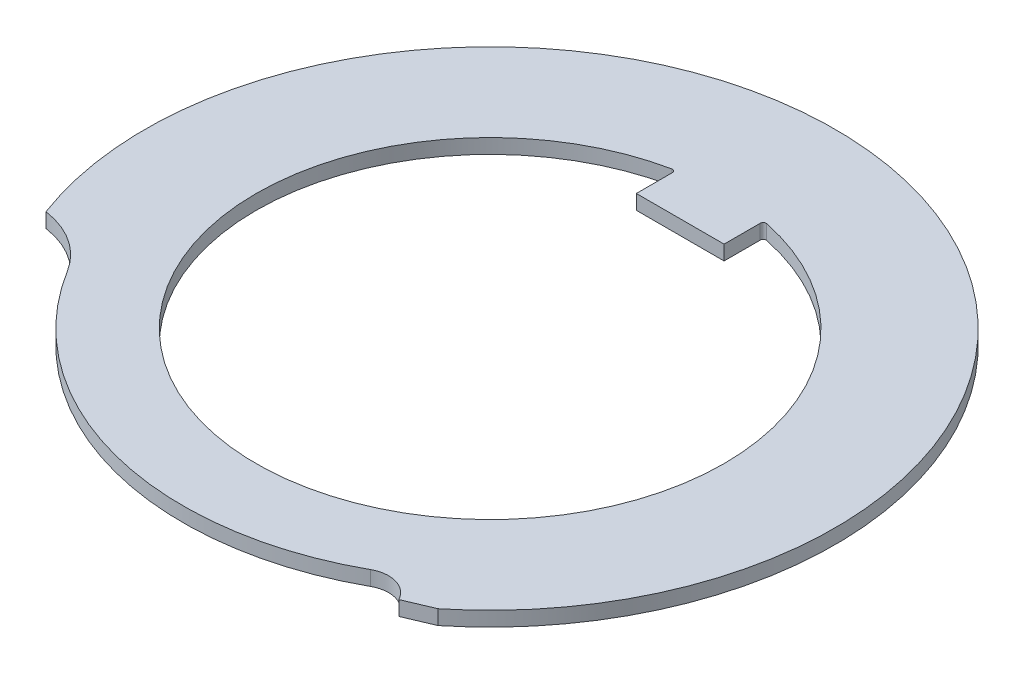
ISO-10303-21;
HEADER;
FILE_DESCRIPTION(('STEP AP214'),'2;1');
FILE_NAME('part.step','',(''),(''),'','','');
FILE_SCHEMA(('AUTOMOTIVE_DESIGN { 1 0 10303 214 1 1 1 1 }'));
ENDSEC;
DATA;
#1=APPLICATION_CONTEXT('core data for automotive mechanical design processes');
#2=APPLICATION_PROTOCOL_DEFINITION('international standard','automotive_design',2000,#1);
#3=PRODUCT_CONTEXT('',#1,'mechanical');
#4=PRODUCT('Part','Part','',(#3));
#5=PRODUCT_RELATED_PRODUCT_CATEGORY('part','',(#4));
#6=PRODUCT_DEFINITION_FORMATION('','',#4);
#7=PRODUCT_DEFINITION_CONTEXT('part definition',#1,'design');
#8=PRODUCT_DEFINITION('design','',#6,#7);
#9=PRODUCT_DEFINITION_SHAPE('','',#8);
#10=(LENGTH_UNIT() NAMED_UNIT(*) SI_UNIT(.MILLI.,.METRE.));
#11=(NAMED_UNIT(*) PLANE_ANGLE_UNIT() SI_UNIT($,.RADIAN.));
#12=(NAMED_UNIT(*) SI_UNIT($,.STERADIAN.) SOLID_ANGLE_UNIT());
#13=UNCERTAINTY_MEASURE_WITH_UNIT(LENGTH_MEASURE(1.E-05),#10,'distance_accuracy_value','');
#14=(GEOMETRIC_REPRESENTATION_CONTEXT(3) GLOBAL_UNCERTAINTY_ASSIGNED_CONTEXT((#13)) GLOBAL_UNIT_ASSIGNED_CONTEXT((#10,
#11,#12)) REPRESENTATION_CONTEXT('',''));
#15=CARTESIAN_POINT('',(0.,0.,0.));
#16=DIRECTION('',(0.,0.,1.));
#17=DIRECTION('',(1.,0.,0.));
#18=AXIS2_PLACEMENT_3D('',#15,#16,#17);
#19=CARTESIAN_POINT('',(5.58222106174194,0.5,10.054293014322));
#20=DIRECTION('',(0.,-1.,0.));
#21=DIRECTION('',(0.,0.,-1.));
#22=AXIS2_PLACEMENT_3D('',#19,#20,#21);
#23=PLANE('',#22);
#24=CARTESIAN_POINT('',(5.58222106174194,0.5,10.054293014322));
#25=DIRECTION('',(0.,-1.,0.));
#26=DIRECTION('',(0.,0.,-1.));
#27=AXIS2_PLACEMENT_3D('',#24,#25,#26);
#28=CIRCLE('',#27,1.);
#29=CARTESIAN_POINT('',(5.09681053463394,0.5,9.18000666525055));
#30=VERTEX_POINT('',#29);
#31=CARTESIAN_POINT('',(6.4656313123906,0.5,9.58569262054406));
#32=VERTEX_POINT('',#31);
#33=EDGE_CURVE('E155',#30,#32,#28,.T.);
#34=ORIENTED_EDGE('',*,*,#33,.T.);
#35=DIRECTION('',(0.920504853452442,0.,-0.390731128489269));
#36=VECTOR('',#35,1.);
#37=CARTESIAN_POINT('',(7.40583378224582,0.5,9.18660034995245));
#38=LINE('',#37,#36);
#39=CARTESIAN_POINT('',(7.40583378224582,0.5,9.18660034995245));
#40=VERTEX_POINT('',#39);
#41=EDGE_CURVE('E158',#32,#40,#38,.T.);
#42=ORIENTED_EDGE('',*,*,#41,.T.);
#43=CARTESIAN_POINT('',(0.,0.5,0.));
#44=DIRECTION('',(0.,1.,0.));
#45=DIRECTION('',(0.,0.,1.));
#46=AXIS2_PLACEMENT_3D('',#43,#44,#45);
#47=CIRCLE('',#46,11.8);
#48=CARTESIAN_POINT('',(-11.0527318331311,0.5,4.1324470988617));
#49=VERTEX_POINT('',#48);
#50=EDGE_CURVE('E161',#40,#49,#47,.T.);
#51=ORIENTED_EDGE('',*,*,#50,.T.);
#52=CARTESIAN_POINT('',(-11.4811052215401,0.5,7.1017056325874));
#53=DIRECTION('',(0.,-1.,0.));
#54=DIRECTION('',(0.,0.,-1.));
#55=AXIS2_PLACEMENT_3D('',#52,#53,#54);
#56=CIRCLE('',#55,2.99999999999999);
#57=CARTESIAN_POINT('',(-8.92974850564234,0.5,5.52354882534576));
#58=VERTEX_POINT('',#57);
#59=EDGE_CURVE('E163',#49,#58,#56,.T.);
#60=ORIENTED_EDGE('',*,*,#59,.T.);
#61=CARTESIAN_POINT('',(0.,0.5,0.));
#62=DIRECTION('',(0.,1.,0.));
#63=DIRECTION('',(0.,0.,1.));
#64=AXIS2_PLACEMENT_3D('',#61,#62,#63);
#65=CIRCLE('',#64,10.5);
#66=EDGE_CURVE('E165',#58,#30,#65,.T.);
#67=ORIENTED_EDGE('',*,*,#66,.T.);
#68=EDGE_LOOP('',(#34,#42,#51,#60,#67));
#69=FACE_BOUND('',#68,.T.);
#70=DIRECTION('',(0.,0.,-1.));
#71=VECTOR('',#70,1.);
#72=CARTESIAN_POINT('',(-1.5,0.5,-6.5));
#73=LINE('',#72,#71);
#74=CARTESIAN_POINT('',(-1.5,0.5,-6.5));
#75=VERTEX_POINT('',#74);
#76=CARTESIAN_POINT('',(-1.5,0.5,-7.73627817493658));
#77=VERTEX_POINT('',#76);
#78=EDGE_CURVE('E132',#75,#77,#73,.T.);
#79=ORIENTED_EDGE('',*,*,#78,.F.);
#80=DIRECTION('',(-1.,0.,0.));
#81=VECTOR('',#80,1.);
#82=CARTESIAN_POINT('',(-1.5,0.5,-6.5));
#83=LINE('',#82,#81);
#84=CARTESIAN_POINT('',(1.5,0.5,-6.5));
#85=VERTEX_POINT('',#84);
#86=EDGE_CURVE('E116',#85,#75,#83,.T.);
#87=ORIENTED_EDGE('',*,*,#86,.F.);
#88=DIRECTION('',(0.,0.,1.));
#89=VECTOR('',#88,1.);
#90=CARTESIAN_POINT('',(1.5,0.5,-6.5));
#91=LINE('',#90,#89);
#92=CARTESIAN_POINT('',(1.5,0.5,-7.73627817493658));
#93=VERTEX_POINT('',#92);
#94=EDGE_CURVE('E126',#93,#85,#91,.T.);
#95=ORIENTED_EDGE('',*,*,#94,.F.);
#96=CARTESIAN_POINT('',(1.6,0.5,-7.73627817493658));
#97=DIRECTION('',(0.,-1.,0.));
#98=DIRECTION('',(0.,0.,-1.));
#99=AXIS2_PLACEMENT_3D('',#96,#97,#98);
#100=CIRCLE('',#99,0.1);
#101=CARTESIAN_POINT('',(1.62025316455696,0.5,-7.83420574677122));
#102=VERTEX_POINT('',#101);
#103=EDGE_CURVE('E11',#93,#102,#100,.T.);
#104=ORIENTED_EDGE('',*,*,#103,.T.);
#105=CARTESIAN_POINT('',(0.,0.5,0.));
#106=DIRECTION('',(0.,1.,0.));
#107=DIRECTION('',(0.,0.,1.));
#108=AXIS2_PLACEMENT_3D('',#105,#106,#107);
#109=CIRCLE('',#108,8.);
#110=CARTESIAN_POINT('',(-1.62025316455696,0.5,-7.83420574677122));
#111=VERTEX_POINT('',#110);
#112=EDGE_CURVE('E140',#111,#102,#109,.T.);
#113=ORIENTED_EDGE('',*,*,#112,.F.);
#114=CARTESIAN_POINT('',(-1.6,0.5,-7.73627817493658));
#115=DIRECTION('',(0.,-1.,0.));
#116=DIRECTION('',(0.,0.,-1.));
#117=AXIS2_PLACEMENT_3D('',#114,#115,#116);
#118=CIRCLE('',#117,0.1);
#119=EDGE_CURVE('E139',#111,#77,#118,.T.);
#120=ORIENTED_EDGE('',*,*,#119,.T.);
#121=EDGE_LOOP('',(#79,#87,#95,#104,#113,#120));
#122=FACE_BOUND('',#121,.T.);
#123=ADVANCED_FACE('F34',(#69,#122),#23,.F.);
#124=CARTESIAN_POINT('',(5.58222106174194,0.,10.054293014322));
#125=DIRECTION('',(0.,-1.,0.));
#126=DIRECTION('',(0.,0.,-1.));
#127=AXIS2_PLACEMENT_3D('',#124,#125,#126);
#128=PLANE('',#127);
#129=CARTESIAN_POINT('',(5.58222106174194,0.,10.054293014322));
#130=DIRECTION('',(0.,-1.,0.));
#131=DIRECTION('',(0.,0.,-1.));
#132=AXIS2_PLACEMENT_3D('',#129,#130,#131);
#133=CIRCLE('',#132,1.);
#134=CARTESIAN_POINT('',(5.09681053463394,0.,9.18000666525055));
#135=VERTEX_POINT('',#134);
#136=CARTESIAN_POINT('',(6.4656313123906,0.,9.58569262054406));
#137=VERTEX_POINT('',#136);
#138=EDGE_CURVE('E154',#135,#137,#133,.T.);
#139=ORIENTED_EDGE('',*,*,#138,.F.);
#140=CARTESIAN_POINT('',(0.,0.,0.));
#141=DIRECTION('',(0.,1.,0.));
#142=DIRECTION('',(0.,0.,1.));
#143=AXIS2_PLACEMENT_3D('',#140,#141,#142);
#144=CIRCLE('',#143,10.5);
#145=CARTESIAN_POINT('',(-8.92974850564234,0.,5.52354882534576));
#146=VERTEX_POINT('',#145);
#147=EDGE_CURVE('E159',#146,#135,#144,.T.);
#148=ORIENTED_EDGE('',*,*,#147,.F.);
#149=CARTESIAN_POINT('',(-11.4811052215401,0.,7.1017056325874));
#150=DIRECTION('',(0.,-1.,0.));
#151=DIRECTION('',(0.,0.,-1.));
#152=AXIS2_PLACEMENT_3D('',#149,#150,#151);
#153=CIRCLE('',#152,2.99999999999999);
#154=CARTESIAN_POINT('',(-11.0527318331311,0.,4.1324470988617));
#155=VERTEX_POINT('',#154);
#156=EDGE_CURVE('E174',#155,#146,#153,.T.);
#157=ORIENTED_EDGE('',*,*,#156,.F.);
#158=CARTESIAN_POINT('',(0.,0.,0.));
#159=DIRECTION('',(0.,1.,0.));
#160=DIRECTION('',(0.,0.,1.));
#161=AXIS2_PLACEMENT_3D('',#158,#159,#160);
#162=CIRCLE('',#161,11.8);
#163=CARTESIAN_POINT('',(7.40583378224582,0.,9.18660034995245));
#164=VERTEX_POINT('',#163);
#165=EDGE_CURVE('E172',#164,#155,#162,.T.);
#166=ORIENTED_EDGE('',*,*,#165,.F.);
#167=DIRECTION('',(0.920504853452442,0.,-0.390731128489269));
#168=VECTOR('',#167,1.);
#169=CARTESIAN_POINT('',(7.40583378224582,0.,9.18660034995245));
#170=LINE('',#169,#168);
#171=EDGE_CURVE('E170',#137,#164,#170,.T.);
#172=ORIENTED_EDGE('',*,*,#171,.F.);
#173=EDGE_LOOP('',(#139,#148,#157,#166,#172));
#174=FACE_BOUND('',#173,.T.);
#175=DIRECTION('',(-1.,0.,0.));
#176=VECTOR('',#175,1.);
#177=CARTESIAN_POINT('',(-1.5,0.,-6.5));
#178=LINE('',#177,#176);
#179=CARTESIAN_POINT('',(1.5,0.,-6.5));
#180=VERTEX_POINT('',#179);
#181=CARTESIAN_POINT('',(-1.5,0.,-6.5));
#182=VERTEX_POINT('',#181);
#183=EDGE_CURVE('E141',#180,#182,#178,.T.);
#184=ORIENTED_EDGE('',*,*,#183,.T.);
#185=DIRECTION('',(0.,0.,-1.));
#186=VECTOR('',#185,1.);
#187=CARTESIAN_POINT('',(-1.5,0.,-6.5));
#188=LINE('',#187,#186);
#189=CARTESIAN_POINT('',(-1.5,0.,-7.73627817493658));
#190=VERTEX_POINT('',#189);
#191=EDGE_CURVE('E135',#182,#190,#188,.T.);
#192=ORIENTED_EDGE('',*,*,#191,.T.);
#193=CARTESIAN_POINT('',(-1.6,0.,-7.73627817493658));
#194=DIRECTION('',(0.,-1.,0.));
#195=DIRECTION('',(0.,0.,-1.));
#196=AXIS2_PLACEMENT_3D('',#193,#194,#195);
#197=CIRCLE('',#196,0.1);
#198=CARTESIAN_POINT('',(-1.62025316455696,0.,-7.83420574677122));
#199=VERTEX_POINT('',#198);
#200=EDGE_CURVE('E199',#190,#199,#197,.F.);
#201=ORIENTED_EDGE('',*,*,#200,.T.);
#202=CARTESIAN_POINT('',(0.,0.,0.));
#203=DIRECTION('',(0.,1.,0.));
#204=DIRECTION('',(0.,0.,1.));
#205=AXIS2_PLACEMENT_3D('',#202,#203,#204);
#206=CIRCLE('',#205,8.);
#207=CARTESIAN_POINT('',(1.62025316455696,0.,-7.83420574677122));
#208=VERTEX_POINT('',#207);
#209=EDGE_CURVE('E150',#199,#208,#206,.T.);
#210=ORIENTED_EDGE('',*,*,#209,.T.);
#211=CARTESIAN_POINT('',(1.6,0.,-7.73627817493658));
#212=DIRECTION('',(0.,-1.,0.));
#213=DIRECTION('',(0.,0.,-1.));
#214=AXIS2_PLACEMENT_3D('',#211,#212,#213);
#215=CIRCLE('',#214,0.1);
#216=CARTESIAN_POINT('',(1.5,0.,-7.73627817493658));
#217=VERTEX_POINT('',#216);
#218=EDGE_CURVE('E42',#208,#217,#215,.F.);
#219=ORIENTED_EDGE('',*,*,#218,.T.);
#220=DIRECTION('',(0.,0.,1.));
#221=VECTOR('',#220,1.);
#222=CARTESIAN_POINT('',(1.5,0.,-6.5));
#223=LINE('',#222,#221);
#224=EDGE_CURVE('E145',#217,#180,#223,.T.);
#225=ORIENTED_EDGE('',*,*,#224,.T.);
#226=EDGE_LOOP('',(#184,#192,#201,#210,#219,#225));
#227=FACE_BOUND('',#226,.T.);
#228=ADVANCED_FACE('F202',(#174,#227),#128,.T.);
#229=CARTESIAN_POINT('',(5.58222106174194,0.5,10.054293014322));
#230=DIRECTION('',(0.,-1.,0.));
#231=DIRECTION('',(0.,0.,-1.));
#232=AXIS2_PLACEMENT_3D('',#229,#230,#231);
#233=CYLINDRICAL_SURFACE('',#232,1.);
#234=ORIENTED_EDGE('',*,*,#138,.T.);
#235=DIRECTION('',(0.,-1.,0.));
#236=VECTOR('',#235,1.);
#237=CARTESIAN_POINT('',(6.4656313123906,0.5,9.58569262054406));
#238=LINE('',#237,#236);
#239=EDGE_CURVE('E188',#32,#137,#238,.T.);
#240=ORIENTED_EDGE('',*,*,#239,.F.);
#241=ORIENTED_EDGE('',*,*,#33,.F.);
#242=DIRECTION('',(0.,-1.,0.));
#243=VECTOR('',#242,1.);
#244=CARTESIAN_POINT('',(5.09681053463394,0.5,9.18000666525055));
#245=LINE('',#244,#243);
#246=EDGE_CURVE('E167',#30,#135,#245,.T.);
#247=ORIENTED_EDGE('',*,*,#246,.T.);
#248=EDGE_LOOP('',(#234,#240,#241,#247));
#249=FACE_BOUND('',#248,.T.);
#250=ADVANCED_FACE('F224',(#249),#233,.F.);
#251=CARTESIAN_POINT('',(7.40583378224582,0.5,9.18660034995245));
#252=DIRECTION('',(-0.390731128489269,0.,-0.920504853452443));
#253=DIRECTION('',(-0.920504853452443,0.,0.390731128489269));
#254=AXIS2_PLACEMENT_3D('',#251,#252,#253);
#255=PLANE('',#254);
#256=ORIENTED_EDGE('',*,*,#171,.T.);
#257=DIRECTION('',(0.,-1.,0.));
#258=VECTOR('',#257,1.);
#259=CARTESIAN_POINT('',(7.40583378224582,0.5,9.18660034995245));
#260=LINE('',#259,#258);
#261=EDGE_CURVE('E185',#40,#164,#260,.T.);
#262=ORIENTED_EDGE('',*,*,#261,.F.);
#263=ORIENTED_EDGE('',*,*,#41,.F.);
#264=ORIENTED_EDGE('',*,*,#239,.T.);
#265=EDGE_LOOP('',(#256,#262,#263,#264));
#266=FACE_BOUND('',#265,.T.);
#267=ADVANCED_FACE('F241',(#266),#255,.F.);
#268=CARTESIAN_POINT('',(0.,0.5,0.));
#269=DIRECTION('',(0.,-1.,0.));
#270=DIRECTION('',(0.,0.,-1.));
#271=AXIS2_PLACEMENT_3D('',#268,#269,#270);
#272=CYLINDRICAL_SURFACE('',#271,11.8);
#273=ORIENTED_EDGE('',*,*,#165,.T.);
#274=DIRECTION('',(0.,-1.,0.));
#275=VECTOR('',#274,1.);
#276=CARTESIAN_POINT('',(-11.0527318331311,0.5,4.1324470988617));
#277=LINE('',#276,#275);
#278=EDGE_CURVE('E182',#49,#155,#277,.T.);
#279=ORIENTED_EDGE('',*,*,#278,.F.);
#280=ORIENTED_EDGE('',*,*,#50,.F.);
#281=ORIENTED_EDGE('',*,*,#261,.T.);
#282=EDGE_LOOP('',(#273,#279,#280,#281));
#283=FACE_BOUND('',#282,.T.);
#284=ADVANCED_FACE('F237',(#283),#272,.T.);
#285=CARTESIAN_POINT('',(-11.4811052215401,0.5,7.1017056325874));
#286=DIRECTION('',(0.,-1.,0.));
#287=DIRECTION('',(0.,0.,-1.));
#288=AXIS2_PLACEMENT_3D('',#285,#286,#287);
#289=CYLINDRICAL_SURFACE('',#288,2.99999999999999);
#290=ORIENTED_EDGE('',*,*,#156,.T.);
#291=DIRECTION('',(0.,-1.,0.));
#292=VECTOR('',#291,1.);
#293=CARTESIAN_POINT('',(-8.92974850564234,0.5,5.52354882534576));
#294=LINE('',#293,#292);
#295=EDGE_CURVE('E179',#58,#146,#294,.T.);
#296=ORIENTED_EDGE('',*,*,#295,.F.);
#297=ORIENTED_EDGE('',*,*,#59,.F.);
#298=ORIENTED_EDGE('',*,*,#278,.T.);
#299=EDGE_LOOP('',(#290,#296,#297,#298));
#300=FACE_BOUND('',#299,.T.);
#301=ADVANCED_FACE('F233',(#300),#289,.F.);
#302=CARTESIAN_POINT('',(0.,0.5,0.));
#303=DIRECTION('',(0.,-1.,0.));
#304=DIRECTION('',(0.,0.,-1.));
#305=AXIS2_PLACEMENT_3D('',#302,#303,#304);
#306=CYLINDRICAL_SURFACE('',#305,10.5);
#307=ORIENTED_EDGE('',*,*,#147,.T.);
#308=ORIENTED_EDGE('',*,*,#246,.F.);
#309=ORIENTED_EDGE('',*,*,#66,.F.);
#310=ORIENTED_EDGE('',*,*,#295,.T.);
#311=EDGE_LOOP('',(#307,#308,#309,#310));
#312=FACE_BOUND('',#311,.T.);
#313=ADVANCED_FACE('F230',(#312),#306,.T.);
#314=CARTESIAN_POINT('',(-1.5,0.5,-6.5));
#315=DIRECTION('',(-1.,0.,0.));
#316=DIRECTION('',(0.,0.,1.));
#317=AXIS2_PLACEMENT_3D('',#314,#315,#316);
#318=PLANE('',#317);
#319=ORIENTED_EDGE('',*,*,#78,.T.);
#320=DIRECTION('',(0.,1.,0.));
#321=VECTOR('',#320,1.);
#322=CARTESIAN_POINT('',(-1.5,0.,-7.73627817493658));
#323=LINE('',#322,#321);
#324=EDGE_CURVE('E191',#77,#190,#323,.F.);
#325=ORIENTED_EDGE('',*,*,#324,.T.);
#326=ORIENTED_EDGE('',*,*,#191,.F.);
#327=DIRECTION('',(0.,-1.,0.));
#328=VECTOR('',#327,1.);
#329=CARTESIAN_POINT('',(-1.5,0.5,-6.5));
#330=LINE('',#329,#328);
#331=EDGE_CURVE('E120',#75,#182,#330,.T.);
#332=ORIENTED_EDGE('',*,*,#331,.F.);
#333=EDGE_LOOP('',(#319,#325,#326,#332));
#334=FACE_BOUND('',#333,.T.);
#335=ADVANCED_FACE('F130',(#334),#318,.T.);
#336=CARTESIAN_POINT('',(0.,0.5,0.));
#337=DIRECTION('',(0.,-1.,0.));
#338=DIRECTION('',(0.,0.,-1.));
#339=AXIS2_PLACEMENT_3D('',#336,#337,#338);
#340=CYLINDRICAL_SURFACE('',#339,8.);
#341=ORIENTED_EDGE('',*,*,#209,.F.);
#342=DIRECTION('',(0.,-1.,0.));
#343=VECTOR('',#342,1.);
#344=CARTESIAN_POINT('',(-1.62025316455696,0.5,-7.83420574677122));
#345=LINE('',#344,#343);
#346=EDGE_CURVE('E196',#199,#111,#345,.F.);
#347=ORIENTED_EDGE('',*,*,#346,.T.);
#348=ORIENTED_EDGE('',*,*,#112,.T.);
#349=DIRECTION('',(0.,-1.,0.));
#350=VECTOR('',#349,1.);
#351=CARTESIAN_POINT('',(1.62025316455696,0.5,-7.83420574677122));
#352=LINE('',#351,#350);
#353=EDGE_CURVE('E193',#102,#208,#352,.T.);
#354=ORIENTED_EDGE('',*,*,#353,.T.);
#355=EDGE_LOOP('',(#341,#347,#348,#354));
#356=FACE_BOUND('',#355,.T.);
#357=ADVANCED_FACE('F206',(#356),#340,.F.);
#358=CARTESIAN_POINT('',(1.5,0.5,-6.5));
#359=DIRECTION('',(1.,0.,0.));
#360=DIRECTION('',(0.,0.,-1.));
#361=AXIS2_PLACEMENT_3D('',#358,#359,#360);
#362=PLANE('',#361);
#363=ORIENTED_EDGE('',*,*,#224,.F.);
#364=DIRECTION('',(0.,1.,0.));
#365=VECTOR('',#364,1.);
#366=CARTESIAN_POINT('',(1.5,0.5,-7.73627817493658));
#367=LINE('',#366,#365);
#368=EDGE_CURVE('E49',#217,#93,#367,.T.);
#369=ORIENTED_EDGE('',*,*,#368,.T.);
#370=ORIENTED_EDGE('',*,*,#94,.T.);
#371=DIRECTION('',(0.,-1.,0.));
#372=VECTOR('',#371,1.);
#373=CARTESIAN_POINT('',(1.5,0.5,-6.5));
#374=LINE('',#373,#372);
#375=EDGE_CURVE('E123',#85,#180,#374,.T.);
#376=ORIENTED_EDGE('',*,*,#375,.T.);
#377=EDGE_LOOP('',(#363,#369,#370,#376));
#378=FACE_BOUND('',#377,.T.);
#379=ADVANCED_FACE('F215',(#378),#362,.T.);
#380=CARTESIAN_POINT('',(-1.5,0.5,-6.5));
#381=DIRECTION('',(0.,0.,1.));
#382=DIRECTION('',(1.,0.,0.));
#383=AXIS2_PLACEMENT_3D('',#380,#381,#382);
#384=PLANE('',#383);
#385=ORIENTED_EDGE('',*,*,#183,.F.);
#386=ORIENTED_EDGE('',*,*,#375,.F.);
#387=ORIENTED_EDGE('',*,*,#86,.T.);
#388=ORIENTED_EDGE('',*,*,#331,.T.);
#389=EDGE_LOOP('',(#385,#386,#387,#388));
#390=FACE_BOUND('',#389,.T.);
#391=ADVANCED_FACE('F119',(#390),#384,.T.);
#392=CARTESIAN_POINT('',(-1.6,0.5,-7.73627817493658));
#393=DIRECTION('',(0.,-1.,0.));
#394=DIRECTION('',(0.,0.,-1.));
#395=AXIS2_PLACEMENT_3D('',#392,#393,#394);
#396=CYLINDRICAL_SURFACE('',#395,0.1);
#397=ORIENTED_EDGE('',*,*,#119,.F.);
#398=ORIENTED_EDGE('',*,*,#346,.F.);
#399=ORIENTED_EDGE('',*,*,#200,.F.);
#400=ORIENTED_EDGE('',*,*,#324,.F.);
#401=EDGE_LOOP('',(#397,#398,#399,#400));
#402=FACE_BOUND('',#401,.T.);
#403=ADVANCED_FACE('F208',(#402),#396,.F.);
#404=CARTESIAN_POINT('',(1.6,0.5,-7.73627817493658));
#405=DIRECTION('',(0.,-1.,0.));
#406=DIRECTION('',(0.,0.,-1.));
#407=AXIS2_PLACEMENT_3D('',#404,#405,#406);
#408=CYLINDRICAL_SURFACE('',#407,0.1);
#409=ORIENTED_EDGE('',*,*,#103,.F.);
#410=ORIENTED_EDGE('',*,*,#368,.F.);
#411=ORIENTED_EDGE('',*,*,#218,.F.);
#412=ORIENTED_EDGE('',*,*,#353,.F.);
#413=EDGE_LOOP('',(#409,#410,#411,#412));
#414=FACE_BOUND('',#413,.T.);
#415=ADVANCED_FACE('F36',(#414),#408,.F.);
#416=CLOSED_SHELL('',(#123,#228,#250,#267,#284,#301,#313,#335,#357,#379,#391,#403,#415));
#417=MANIFOLD_SOLID_BREP('B2',#416);
#418=ADVANCED_BREP_SHAPE_REPRESENTATION('',(#18,#417),#14);
#419=SHAPE_DEFINITION_REPRESENTATION(#9,#418);
ENDSEC;
END-ISO-10303-21;
